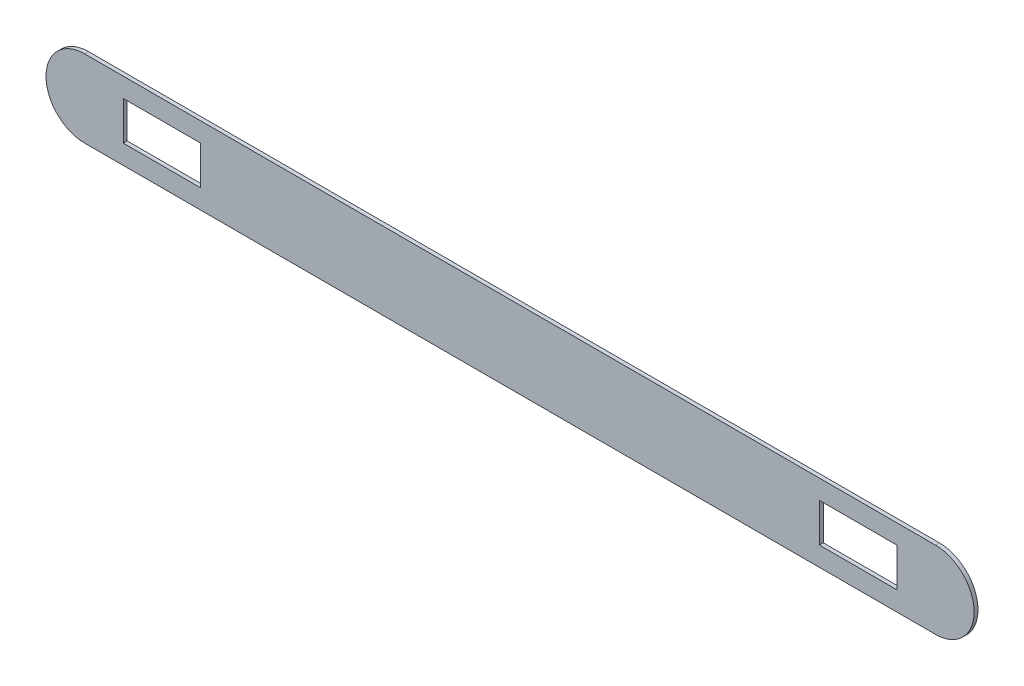
ISO-10303-21;
HEADER;
FILE_DESCRIPTION(('STEP AP214'),'2;1');
FILE_NAME('part.step','',(''),(''),'','','');
FILE_SCHEMA(('AUTOMOTIVE_DESIGN { 1 0 10303 214 1 1 1 1 }'));
ENDSEC;
DATA;
#1=APPLICATION_CONTEXT('core data for automotive mechanical design processes');
#2=APPLICATION_PROTOCOL_DEFINITION('international standard','automotive_design',2000,#1);
#3=PRODUCT_CONTEXT('',#1,'mechanical');
#4=PRODUCT('Part','Part','',(#3));
#5=PRODUCT_RELATED_PRODUCT_CATEGORY('part','',(#4));
#6=PRODUCT_DEFINITION_FORMATION('','',#4);
#7=PRODUCT_DEFINITION_CONTEXT('part definition',#1,'design');
#8=PRODUCT_DEFINITION('design','',#6,#7);
#9=PRODUCT_DEFINITION_SHAPE('','',#8);
#10=(LENGTH_UNIT() NAMED_UNIT(*) SI_UNIT(.MILLI.,.METRE.));
#11=(NAMED_UNIT(*) PLANE_ANGLE_UNIT() SI_UNIT($,.RADIAN.));
#12=(NAMED_UNIT(*) SI_UNIT($,.STERADIAN.) SOLID_ANGLE_UNIT());
#13=UNCERTAINTY_MEASURE_WITH_UNIT(LENGTH_MEASURE(1.E-05),#10,'distance_accuracy_value','');
#14=(GEOMETRIC_REPRESENTATION_CONTEXT(3) GLOBAL_UNCERTAINTY_ASSIGNED_CONTEXT((#13)) GLOBAL_UNIT_ASSIGNED_CONTEXT((#10,
#11,#12)) REPRESENTATION_CONTEXT('',''));
#15=CARTESIAN_POINT('',(0.,0.,0.));
#16=DIRECTION('',(0.,0.,1.));
#17=DIRECTION('',(1.,0.,0.));
#18=AXIS2_PLACEMENT_3D('',#15,#16,#17);
#19=CARTESIAN_POINT('',(-502.733741957931,0.,0.));
#20=DIRECTION('',(0.,0.,1.));
#21=DIRECTION('',(1.,0.,0.));
#22=AXIS2_PLACEMENT_3D('',#19,#20,#21);
#23=PLANE('',#22);
#24=DIRECTION('',(-1.,0.,0.));
#25=VECTOR('',#24,1.);
#26=CARTESIAN_POINT('',(-502.733741957931,25.,0.));
#27=LINE('',#26,#25);
#28=CARTESIAN_POINT('',(-352.733741957931,25.,0.));
#29=VERTEX_POINT('',#28);
#30=CARTESIAN_POINT('',(-452.733741957932,25.,0.));
#31=VERTEX_POINT('',#30);
#32=EDGE_CURVE('E185',#29,#31,#27,.T.);
#33=ORIENTED_EDGE('',*,*,#32,.T.);
#34=DIRECTION('',(0.,-1.,0.));
#35=VECTOR('',#34,1.);
#36=CARTESIAN_POINT('',(-452.733741957932,0.,0.));
#37=LINE('',#36,#35);
#38=CARTESIAN_POINT('',(-452.733741957932,-25.,0.));
#39=VERTEX_POINT('',#38);
#40=EDGE_CURVE('E188',#31,#39,#37,.T.);
#41=ORIENTED_EDGE('',*,*,#40,.T.);
#42=DIRECTION('',(1.,0.,0.));
#43=VECTOR('',#42,1.);
#44=CARTESIAN_POINT('',(-502.733741957931,-25.,0.));
#45=LINE('',#44,#43);
#46=CARTESIAN_POINT('',(-352.733741957931,-25.,0.));
#47=VERTEX_POINT('',#46);
#48=EDGE_CURVE('E182',#39,#47,#45,.T.);
#49=ORIENTED_EDGE('',*,*,#48,.T.);
#50=DIRECTION('',(0.,1.,0.));
#51=VECTOR('',#50,1.);
#52=CARTESIAN_POINT('',(-352.733741957931,0.,0.));
#53=LINE('',#52,#51);
#54=EDGE_CURVE('E127',#47,#29,#53,.T.);
#55=ORIENTED_EDGE('',*,*,#54,.T.);
#56=EDGE_LOOP('',(#33,#41,#49,#55));
#57=FACE_BOUND('',#56,.T.);
#58=DIRECTION('',(-1.,0.,0.));
#59=VECTOR('',#58,1.);
#60=CARTESIAN_POINT('',(-502.733741957931,25.0000000000004,0.));
#61=LINE('',#60,#59);
#62=CARTESIAN_POINT('',(547.266258042068,25.,0.));
#63=VERTEX_POINT('',#62);
#64=CARTESIAN_POINT('',(447.266258042068,25.,0.));
#65=VERTEX_POINT('',#64);
#66=EDGE_CURVE('E176',#63,#65,#61,.T.);
#67=ORIENTED_EDGE('',*,*,#66,.T.);
#68=DIRECTION('',(0.,-1.,0.));
#69=VECTOR('',#68,1.);
#70=CARTESIAN_POINT('',(447.266258042068,0.,0.));
#71=LINE('',#70,#69);
#72=CARTESIAN_POINT('',(447.266258042068,-25.,0.));
#73=VERTEX_POINT('',#72);
#74=EDGE_CURVE('E179',#65,#73,#71,.T.);
#75=ORIENTED_EDGE('',*,*,#74,.T.);
#76=DIRECTION('',(1.,0.,0.));
#77=VECTOR('',#76,1.);
#78=CARTESIAN_POINT('',(-502.733741957931,-25.,0.));
#79=LINE('',#78,#77);
#80=CARTESIAN_POINT('',(547.266258042068,-25.,0.));
#81=VERTEX_POINT('',#80);
#82=EDGE_CURVE('E150',#73,#81,#79,.T.);
#83=ORIENTED_EDGE('',*,*,#82,.T.);
#84=DIRECTION('',(0.,1.,0.));
#85=VECTOR('',#84,1.);
#86=CARTESIAN_POINT('',(547.266258042068,0.,0.));
#87=LINE('',#86,#85);
#88=EDGE_CURVE('E173',#81,#63,#87,.T.);
#89=ORIENTED_EDGE('',*,*,#88,.T.);
#90=EDGE_LOOP('',(#67,#75,#83,#89));
#91=FACE_BOUND('',#90,.T.);
#92=CARTESIAN_POINT('',(-502.733741957931,0.,0.));
#93=DIRECTION('',(0.,0.,1.));
#94=DIRECTION('',(1.,0.,0.));
#95=AXIS2_PLACEMENT_3D('',#92,#93,#94);
#96=CIRCLE('',#95,50.);
#97=CARTESIAN_POINT('',(-502.733741957931,50.,0.));
#98=VERTEX_POINT('',#97);
#99=CARTESIAN_POINT('',(-502.733741957931,-50.,0.));
#100=VERTEX_POINT('',#99);
#101=EDGE_CURVE('E212',#98,#100,#96,.T.);
#102=ORIENTED_EDGE('',*,*,#101,.F.);
#103=DIRECTION('',(-1.,0.,0.));
#104=VECTOR('',#103,1.);
#105=CARTESIAN_POINT('',(-502.733741957931,50.,0.));
#106=LINE('',#105,#104);
#107=CARTESIAN_POINT('',(597.266258042068,50.,0.));
#108=VERTEX_POINT('',#107);
#109=EDGE_CURVE('E197',#108,#98,#106,.T.);
#110=ORIENTED_EDGE('',*,*,#109,.F.);
#111=CARTESIAN_POINT('',(597.266258042068,0.,0.));
#112=DIRECTION('',(0.,0.,1.));
#113=DIRECTION('',(1.,0.,0.));
#114=AXIS2_PLACEMENT_3D('',#111,#112,#113);
#115=CIRCLE('',#114,50.);
#116=CARTESIAN_POINT('',(597.266258042068,-50.,0.));
#117=VERTEX_POINT('',#116);
#118=EDGE_CURVE('E206',#117,#108,#115,.T.);
#119=ORIENTED_EDGE('',*,*,#118,.F.);
#120=DIRECTION('',(1.,0.,0.));
#121=VECTOR('',#120,1.);
#122=CARTESIAN_POINT('',(-502.733741957931,-50.,0.));
#123=LINE('',#122,#121);
#124=EDGE_CURVE('E11',#100,#117,#123,.T.);
#125=ORIENTED_EDGE('',*,*,#124,.F.);
#126=EDGE_LOOP('',(#102,#110,#119,#125));
#127=FACE_BOUND('',#126,.T.);
#128=ADVANCED_FACE('F32',(#57,#91,#127),#23,.F.);
#129=CARTESIAN_POINT('',(-502.733741957931,-50.,80.));
#130=DIRECTION('',(0.,1.,0.));
#131=DIRECTION('',(0.,0.,1.));
#132=AXIS2_PLACEMENT_3D('',#129,#130,#131);
#133=PLANE('',#132);
#134=DIRECTION('',(0.,0.,-1.));
#135=VECTOR('',#134,1.);
#136=CARTESIAN_POINT('',(597.266258042068,-50.,80.));
#137=LINE('',#136,#135);
#138=CARTESIAN_POINT('',(597.266258042068,-50.,5.));
#139=VERTEX_POINT('',#138);
#140=EDGE_CURVE('E207',#139,#117,#137,.T.);
#141=ORIENTED_EDGE('',*,*,#140,.F.);
#142=DIRECTION('',(-1.,0.,0.));
#143=VECTOR('',#142,1.);
#144=CARTESIAN_POINT('',(-502.733741957931,-50.,5.));
#145=LINE('',#144,#143);
#146=CARTESIAN_POINT('',(-502.733741957931,-50.,5.));
#147=VERTEX_POINT('',#146);
#148=EDGE_CURVE('E203',#139,#147,#145,.T.);
#149=ORIENTED_EDGE('',*,*,#148,.T.);
#150=DIRECTION('',(0.,0.,-1.));
#151=VECTOR('',#150,1.);
#152=CARTESIAN_POINT('',(-502.733741957931,-50.,80.));
#153=LINE('',#152,#151);
#154=EDGE_CURVE('E210',#147,#100,#153,.T.);
#155=ORIENTED_EDGE('',*,*,#154,.T.);
#156=ORIENTED_EDGE('',*,*,#124,.T.);
#157=EDGE_LOOP('',(#141,#149,#155,#156));
#158=FACE_BOUND('',#157,.T.);
#159=ADVANCED_FACE('F222',(#158),#133,.F.);
#160=CARTESIAN_POINT('',(-502.733741957931,0.,80.));
#161=DIRECTION('',(0.,0.,-1.));
#162=DIRECTION('',(-1.,0.,0.));
#163=AXIS2_PLACEMENT_3D('',#160,#161,#162);
#164=CYLINDRICAL_SURFACE('',#163,50.);
#165=CARTESIAN_POINT('',(-502.733741957931,0.,5.));
#166=DIRECTION('',(0.,0.,1.));
#167=DIRECTION('',(1.,0.,0.));
#168=AXIS2_PLACEMENT_3D('',#165,#166,#167);
#169=CIRCLE('',#168,50.);
#170=CARTESIAN_POINT('',(-502.733741957931,50.,5.));
#171=VERTEX_POINT('',#170);
#172=EDGE_CURVE('E36',#171,#147,#169,.T.);
#173=ORIENTED_EDGE('',*,*,#172,.F.);
#174=DIRECTION('',(0.,0.,-1.));
#175=VECTOR('',#174,1.);
#176=CARTESIAN_POINT('',(-502.733741957931,50.,80.));
#177=LINE('',#176,#175);
#178=EDGE_CURVE('E194',#171,#98,#177,.T.);
#179=ORIENTED_EDGE('',*,*,#178,.T.);
#180=ORIENTED_EDGE('',*,*,#101,.T.);
#181=ORIENTED_EDGE('',*,*,#154,.F.);
#182=EDGE_LOOP('',(#173,#179,#180,#181));
#183=FACE_BOUND('',#182,.T.);
#184=ADVANCED_FACE('F225',(#183),#164,.T.);
#185=CARTESIAN_POINT('',(597.266258042068,0.,80.));
#186=DIRECTION('',(0.,0.,-1.));
#187=DIRECTION('',(-1.,0.,0.));
#188=AXIS2_PLACEMENT_3D('',#185,#186,#187);
#189=CYLINDRICAL_SURFACE('',#188,50.);
#190=ORIENTED_EDGE('',*,*,#118,.T.);
#191=DIRECTION('',(0.,0.,-1.));
#192=VECTOR('',#191,1.);
#193=CARTESIAN_POINT('',(597.266258042068,50.,80.));
#194=LINE('',#193,#192);
#195=CARTESIAN_POINT('',(597.266258042068,50.,5.));
#196=VERTEX_POINT('',#195);
#197=EDGE_CURVE('E191',#196,#108,#194,.T.);
#198=ORIENTED_EDGE('',*,*,#197,.F.);
#199=CARTESIAN_POINT('',(597.266258042068,0.,5.));
#200=DIRECTION('',(0.,0.,1.));
#201=DIRECTION('',(1.,0.,0.));
#202=AXIS2_PLACEMENT_3D('',#199,#200,#201);
#203=CIRCLE('',#202,50.);
#204=EDGE_CURVE('E209',#139,#196,#203,.T.);
#205=ORIENTED_EDGE('',*,*,#204,.F.);
#206=ORIENTED_EDGE('',*,*,#140,.T.);
#207=EDGE_LOOP('',(#190,#198,#205,#206));
#208=FACE_BOUND('',#207,.T.);
#209=ADVANCED_FACE('F227',(#208),#189,.T.);
#210=CARTESIAN_POINT('',(597.266258042068,-45.,5.));
#211=DIRECTION('',(0.,0.,1.));
#212=DIRECTION('',(1.,0.,0.));
#213=AXIS2_PLACEMENT_3D('',#210,#211,#212);
#214=PLANE('',#213);
#215=DIRECTION('',(0.,-1.,0.));
#216=VECTOR('',#215,1.);
#217=CARTESIAN_POINT('',(-452.733741957932,25.,5.));
#218=LINE('',#217,#216);
#219=CARTESIAN_POINT('',(-452.733741957932,25.,5.));
#220=VERTEX_POINT('',#219);
#221=CARTESIAN_POINT('',(-452.733741957931,-25.,5.));
#222=VERTEX_POINT('',#221);
#223=EDGE_CURVE('E139',#220,#222,#218,.T.);
#224=ORIENTED_EDGE('',*,*,#223,.F.);
#225=DIRECTION('',(-1.,0.,0.));
#226=VECTOR('',#225,1.);
#227=CARTESIAN_POINT('',(-452.733741957932,25.,5.));
#228=LINE('',#227,#226);
#229=CARTESIAN_POINT('',(-352.733741957931,25.,5.));
#230=VERTEX_POINT('',#229);
#231=EDGE_CURVE('E143',#230,#220,#228,.T.);
#232=ORIENTED_EDGE('',*,*,#231,.F.);
#233=DIRECTION('',(0.,1.,0.));
#234=VECTOR('',#233,1.);
#235=CARTESIAN_POINT('',(-352.733741957931,25.,5.));
#236=LINE('',#235,#234);
#237=CARTESIAN_POINT('',(-352.733741957931,-25.,5.));
#238=VERTEX_POINT('',#237);
#239=EDGE_CURVE('E124',#238,#230,#236,.T.);
#240=ORIENTED_EDGE('',*,*,#239,.F.);
#241=DIRECTION('',(1.,0.,0.));
#242=VECTOR('',#241,1.);
#243=CARTESIAN_POINT('',(-452.733741957932,-25.,5.));
#244=LINE('',#243,#242);
#245=EDGE_CURVE('E134',#222,#238,#244,.T.);
#246=ORIENTED_EDGE('',*,*,#245,.F.);
#247=EDGE_LOOP('',(#224,#232,#240,#246));
#248=FACE_BOUND('',#247,.T.);
#249=DIRECTION('',(0.,-1.,0.));
#250=VECTOR('',#249,1.);
#251=CARTESIAN_POINT('',(447.266258042068,25.,5.));
#252=LINE('',#251,#250);
#253=CARTESIAN_POINT('',(447.266258042068,25.,5.));
#254=VERTEX_POINT('',#253);
#255=CARTESIAN_POINT('',(447.266258042068,-25.,5.));
#256=VERTEX_POINT('',#255);
#257=EDGE_CURVE('E153',#254,#256,#252,.T.);
#258=ORIENTED_EDGE('',*,*,#257,.F.);
#259=DIRECTION('',(-1.,0.,0.));
#260=VECTOR('',#259,1.);
#261=CARTESIAN_POINT('',(447.266258042068,25.,5.));
#262=LINE('',#261,#260);
#263=CARTESIAN_POINT('',(547.266258042068,25.,5.));
#264=VERTEX_POINT('',#263);
#265=EDGE_CURVE('E160',#264,#254,#262,.T.);
#266=ORIENTED_EDGE('',*,*,#265,.F.);
#267=DIRECTION('',(0.,1.,0.));
#268=VECTOR('',#267,1.);
#269=CARTESIAN_POINT('',(547.266258042068,25.,5.));
#270=LINE('',#269,#268);
#271=CARTESIAN_POINT('',(547.266258042068,-25.,5.));
#272=VERTEX_POINT('',#271);
#273=EDGE_CURVE('E157',#272,#264,#270,.T.);
#274=ORIENTED_EDGE('',*,*,#273,.F.);
#275=DIRECTION('',(1.,0.,0.));
#276=VECTOR('',#275,1.);
#277=CARTESIAN_POINT('',(447.266258042068,-25.,5.));
#278=LINE('',#277,#276);
#279=EDGE_CURVE('E155',#256,#272,#278,.T.);
#280=ORIENTED_EDGE('',*,*,#279,.F.);
#281=EDGE_LOOP('',(#258,#266,#274,#280));
#282=FACE_BOUND('',#281,.T.);
#283=ORIENTED_EDGE('',*,*,#204,.T.);
#284=DIRECTION('',(1.,0.,0.));
#285=VECTOR('',#284,1.);
#286=CARTESIAN_POINT('',(-502.733741957931,50.,5.));
#287=LINE('',#286,#285);
#288=EDGE_CURVE('E200',#171,#196,#287,.T.);
#289=ORIENTED_EDGE('',*,*,#288,.F.);
#290=ORIENTED_EDGE('',*,*,#172,.T.);
#291=ORIENTED_EDGE('',*,*,#148,.F.);
#292=EDGE_LOOP('',(#283,#289,#290,#291));
#293=FACE_BOUND('',#292,.T.);
#294=ADVANCED_FACE('F34',(#248,#282,#293),#214,.T.);
#295=CARTESIAN_POINT('',(-502.733741957931,50.,80.));
#296=DIRECTION('',(0.,-1.,0.));
#297=DIRECTION('',(0.,0.,-1.));
#298=AXIS2_PLACEMENT_3D('',#295,#296,#297);
#299=PLANE('',#298);
#300=ORIENTED_EDGE('',*,*,#178,.F.);
#301=ORIENTED_EDGE('',*,*,#288,.T.);
#302=ORIENTED_EDGE('',*,*,#197,.T.);
#303=ORIENTED_EDGE('',*,*,#109,.T.);
#304=EDGE_LOOP('',(#300,#301,#302,#303));
#305=FACE_BOUND('',#304,.T.);
#306=ADVANCED_FACE('F247',(#305),#299,.F.);
#307=CARTESIAN_POINT('',(447.266258042068,25.,-5.));
#308=DIRECTION('',(-1.,0.,0.));
#309=DIRECTION('',(0.,0.,1.));
#310=AXIS2_PLACEMENT_3D('',#307,#308,#309);
#311=PLANE('',#310);
#312=DIRECTION('',(0.,0.,1.));
#313=VECTOR('',#312,1.);
#314=CARTESIAN_POINT('',(447.266258042068,25.,-5.));
#315=LINE('',#314,#313);
#316=EDGE_CURVE('E164',#65,#254,#315,.T.);
#317=ORIENTED_EDGE('',*,*,#316,.T.);
#318=ORIENTED_EDGE('',*,*,#257,.T.);
#319=DIRECTION('',(0.,0.,1.));
#320=VECTOR('',#319,1.);
#321=CARTESIAN_POINT('',(447.266258042068,-25.,-5.));
#322=LINE('',#321,#320);
#323=EDGE_CURVE('E163',#73,#256,#322,.T.);
#324=ORIENTED_EDGE('',*,*,#323,.F.);
#325=ORIENTED_EDGE('',*,*,#74,.F.);
#326=EDGE_LOOP('',(#317,#318,#324,#325));
#327=FACE_BOUND('',#326,.T.);
#328=ADVANCED_FACE('F250',(#327),#311,.F.);
#329=CARTESIAN_POINT('',(447.266258042068,25.,-5.));
#330=DIRECTION('',(0.,1.,0.));
#331=DIRECTION('',(-1.,0.,0.));
#332=AXIS2_PLACEMENT_3D('',#329,#330,#331);
#333=PLANE('',#332);
#334=DIRECTION('',(0.,0.,1.));
#335=VECTOR('',#334,1.);
#336=CARTESIAN_POINT('',(547.266258042068,25.,-5.));
#337=LINE('',#336,#335);
#338=EDGE_CURVE('E166',#63,#264,#337,.T.);
#339=ORIENTED_EDGE('',*,*,#338,.T.);
#340=ORIENTED_EDGE('',*,*,#265,.T.);
#341=ORIENTED_EDGE('',*,*,#316,.F.);
#342=ORIENTED_EDGE('',*,*,#66,.F.);
#343=EDGE_LOOP('',(#339,#340,#341,#342));
#344=FACE_BOUND('',#343,.T.);
#345=ADVANCED_FACE('F257',(#344),#333,.F.);
#346=CARTESIAN_POINT('',(547.266258042068,25.,-5.));
#347=DIRECTION('',(1.,0.,0.));
#348=DIRECTION('',(0.,0.,-1.));
#349=AXIS2_PLACEMENT_3D('',#346,#347,#348);
#350=PLANE('',#349);
#351=DIRECTION('',(0.,0.,1.));
#352=VECTOR('',#351,1.);
#353=CARTESIAN_POINT('',(547.266258042068,-25.,-5.));
#354=LINE('',#353,#352);
#355=EDGE_CURVE('E56',#81,#272,#354,.T.);
#356=ORIENTED_EDGE('',*,*,#355,.T.);
#357=ORIENTED_EDGE('',*,*,#273,.T.);
#358=ORIENTED_EDGE('',*,*,#338,.F.);
#359=ORIENTED_EDGE('',*,*,#88,.F.);
#360=EDGE_LOOP('',(#356,#357,#358,#359));
#361=FACE_BOUND('',#360,.T.);
#362=ADVANCED_FACE('F265',(#361),#350,.F.);
#363=CARTESIAN_POINT('',(447.266258042068,-25.,-5.));
#364=DIRECTION('',(0.,-1.,0.));
#365=DIRECTION('',(0.,0.,-1.));
#366=AXIS2_PLACEMENT_3D('',#363,#364,#365);
#367=PLANE('',#366);
#368=ORIENTED_EDGE('',*,*,#323,.T.);
#369=ORIENTED_EDGE('',*,*,#279,.T.);
#370=ORIENTED_EDGE('',*,*,#355,.F.);
#371=ORIENTED_EDGE('',*,*,#82,.F.);
#372=EDGE_LOOP('',(#368,#369,#370,#371));
#373=FACE_BOUND('',#372,.T.);
#374=ADVANCED_FACE('F261',(#373),#367,.F.);
#375=CARTESIAN_POINT('',(-452.733741957932,25.,-5.));
#376=DIRECTION('',(-1.,0.,0.));
#377=DIRECTION('',(0.,0.,1.));
#378=AXIS2_PLACEMENT_3D('',#375,#376,#377);
#379=PLANE('',#378);
#380=DIRECTION('',(0.,0.,1.));
#381=VECTOR('',#380,1.);
#382=CARTESIAN_POINT('',(-452.733741957932,25.,-5.));
#383=LINE('',#382,#381);
#384=EDGE_CURVE('E148',#31,#220,#383,.T.);
#385=ORIENTED_EDGE('',*,*,#384,.T.);
#386=ORIENTED_EDGE('',*,*,#223,.T.);
#387=DIRECTION('',(0.,0.,1.));
#388=VECTOR('',#387,1.);
#389=CARTESIAN_POINT('',(-452.733741957932,-25.,-5.));
#390=LINE('',#389,#388);
#391=EDGE_CURVE('E130',#39,#222,#390,.T.);
#392=ORIENTED_EDGE('',*,*,#391,.F.);
#393=ORIENTED_EDGE('',*,*,#40,.F.);
#394=EDGE_LOOP('',(#385,#386,#392,#393));
#395=FACE_BOUND('',#394,.T.);
#396=ADVANCED_FACE('F264',(#395),#379,.F.);
#397=CARTESIAN_POINT('',(-452.733741957932,25.,-5.));
#398=DIRECTION('',(0.,1.,0.));
#399=DIRECTION('',(0.,0.,1.));
#400=AXIS2_PLACEMENT_3D('',#397,#398,#399);
#401=PLANE('',#400);
#402=DIRECTION('',(0.,0.,1.));
#403=VECTOR('',#402,1.);
#404=CARTESIAN_POINT('',(-352.733741957931,25.,-5.));
#405=LINE('',#404,#403);
#406=EDGE_CURVE('E129',#29,#230,#405,.T.);
#407=ORIENTED_EDGE('',*,*,#406,.T.);
#408=ORIENTED_EDGE('',*,*,#231,.T.);
#409=ORIENTED_EDGE('',*,*,#384,.F.);
#410=ORIENTED_EDGE('',*,*,#32,.F.);
#411=EDGE_LOOP('',(#407,#408,#409,#410));
#412=FACE_BOUND('',#411,.T.);
#413=ADVANCED_FACE('F274',(#412),#401,.F.);
#414=CARTESIAN_POINT('',(-352.733741957931,25.,-5.));
#415=DIRECTION('',(1.,0.,0.));
#416=DIRECTION('',(0.,0.,-1.));
#417=AXIS2_PLACEMENT_3D('',#414,#415,#416);
#418=PLANE('',#417);
#419=DIRECTION('',(0.,0.,1.));
#420=VECTOR('',#419,1.);
#421=CARTESIAN_POINT('',(-352.733741957931,-25.,-5.));
#422=LINE('',#421,#420);
#423=EDGE_CURVE('E48',#47,#238,#422,.T.);
#424=ORIENTED_EDGE('',*,*,#423,.T.);
#425=ORIENTED_EDGE('',*,*,#239,.T.);
#426=ORIENTED_EDGE('',*,*,#406,.F.);
#427=ORIENTED_EDGE('',*,*,#54,.F.);
#428=EDGE_LOOP('',(#424,#425,#426,#427));
#429=FACE_BOUND('',#428,.T.);
#430=ADVANCED_FACE('F121',(#429),#418,.F.);
#431=CARTESIAN_POINT('',(-452.733741957932,-25.,-5.));
#432=DIRECTION('',(0.,-1.,0.));
#433=DIRECTION('',(0.,0.,-1.));
#434=AXIS2_PLACEMENT_3D('',#431,#432,#433);
#435=PLANE('',#434);
#436=ORIENTED_EDGE('',*,*,#391,.T.);
#437=ORIENTED_EDGE('',*,*,#245,.T.);
#438=ORIENTED_EDGE('',*,*,#423,.F.);
#439=ORIENTED_EDGE('',*,*,#48,.F.);
#440=EDGE_LOOP('',(#436,#437,#438,#439));
#441=FACE_BOUND('',#440,.T.);
#442=ADVANCED_FACE('F135',(#441),#435,.F.);
#443=CLOSED_SHELL('',(#128,#159,#184,#209,#294,#306,#328,#345,#362,#374,#396,#413,#430,#442));
#444=MANIFOLD_SOLID_BREP('B2',#443);
#445=ADVANCED_BREP_SHAPE_REPRESENTATION('',(#18,#444),#14);
#446=SHAPE_DEFINITION_REPRESENTATION(#9,#445);
ENDSEC;
END-ISO-10303-21;
